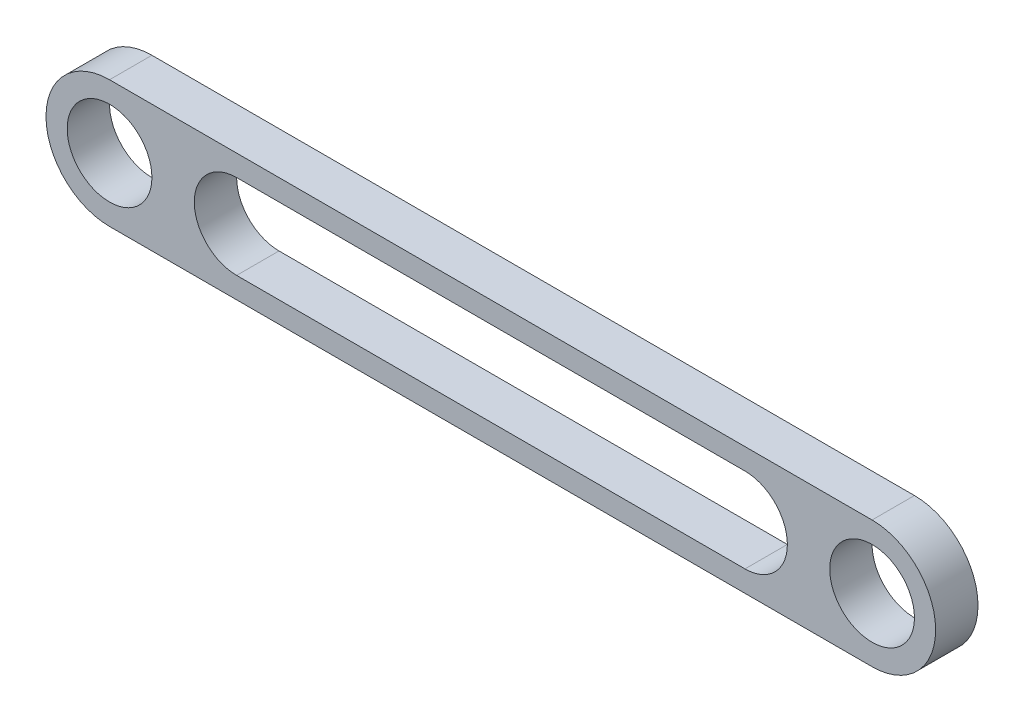
ISO-10303-21;
HEADER;
FILE_DESCRIPTION(('STEP AP214'),'2;1');
FILE_NAME('part.step','',(''),(''),'','','');
FILE_SCHEMA(('AUTOMOTIVE_DESIGN { 1 0 10303 214 1 1 1 1 }'));
ENDSEC;
DATA;
#1=APPLICATION_CONTEXT('core data for automotive mechanical design processes');
#2=APPLICATION_PROTOCOL_DEFINITION('international standard','automotive_design',2000,#1);
#3=PRODUCT_CONTEXT('',#1,'mechanical');
#4=PRODUCT('Part','Part','',(#3));
#5=PRODUCT_RELATED_PRODUCT_CATEGORY('part','',(#4));
#6=PRODUCT_DEFINITION_FORMATION('','',#4);
#7=PRODUCT_DEFINITION_CONTEXT('part definition',#1,'design');
#8=PRODUCT_DEFINITION('design','',#6,#7);
#9=PRODUCT_DEFINITION_SHAPE('','',#8);
#10=(LENGTH_UNIT() NAMED_UNIT(*) SI_UNIT(.MILLI.,.METRE.));
#11=(NAMED_UNIT(*) PLANE_ANGLE_UNIT() SI_UNIT($,.RADIAN.));
#12=(NAMED_UNIT(*) SI_UNIT($,.STERADIAN.) SOLID_ANGLE_UNIT());
#13=UNCERTAINTY_MEASURE_WITH_UNIT(LENGTH_MEASURE(1.E-05),#10,'distance_accuracy_value','');
#14=(GEOMETRIC_REPRESENTATION_CONTEXT(3) GLOBAL_UNCERTAINTY_ASSIGNED_CONTEXT((#13)) GLOBAL_UNIT_ASSIGNED_CONTEXT((#10,
#11,#12)) REPRESENTATION_CONTEXT('',''));
#15=CARTESIAN_POINT('',(0.,0.,0.));
#16=DIRECTION('',(0.,0.,1.));
#17=DIRECTION('',(1.,0.,0.));
#18=AXIS2_PLACEMENT_3D('',#15,#16,#17);
#19=CARTESIAN_POINT('',(0.,0.,10.));
#20=DIRECTION('',(0.,0.,1.));
#21=DIRECTION('',(1.,0.,0.));
#22=AXIS2_PLACEMENT_3D('',#19,#20,#21);
#23=PLANE('',#22);
#24=CARTESIAN_POINT('',(0.,0.,10.));
#25=DIRECTION('',(0.,0.,1.));
#26=DIRECTION('',(1.,0.,0.));
#27=AXIS2_PLACEMENT_3D('',#24,#25,#26);
#28=CIRCLE('',#27,10.);
#29=CARTESIAN_POINT('',(10.,0.,10.));
#30=VERTEX_POINT('',#29);
#31=EDGE_CURVE('E167',#30,#30,#28,.T.);
#32=ORIENTED_EDGE('',*,*,#31,.F.);
#33=EDGE_LOOP('',(#32));
#34=FACE_BOUND('',#33,.T.);
#35=CARTESIAN_POINT('',(0.,0.,10.));
#36=DIRECTION('',(0.,0.,1.));
#37=DIRECTION('',(1.,0.,0.));
#38=AXIS2_PLACEMENT_3D('',#35,#36,#37);
#39=CIRCLE('',#38,15.);
#40=CARTESIAN_POINT('',(0.,15.,10.));
#41=VERTEX_POINT('',#40);
#42=CARTESIAN_POINT('',(0.,-15.,10.));
#43=VERTEX_POINT('',#42);
#44=EDGE_CURVE('E175',#41,#43,#39,.T.);
#45=ORIENTED_EDGE('',*,*,#44,.T.);
#46=DIRECTION('',(1.,0.,0.));
#47=VECTOR('',#46,1.);
#48=CARTESIAN_POINT('',(0.,-15.,10.));
#49=LINE('',#48,#47);
#50=CARTESIAN_POINT('',(180.,-15.,10.));
#51=VERTEX_POINT('',#50);
#52=EDGE_CURVE('E179',#43,#51,#49,.T.);
#53=ORIENTED_EDGE('',*,*,#52,.T.);
#54=CARTESIAN_POINT('',(180.,0.,10.));
#55=DIRECTION('',(0.,0.,1.));
#56=DIRECTION('',(1.,0.,0.));
#57=AXIS2_PLACEMENT_3D('',#54,#55,#56);
#58=CIRCLE('',#57,15.);
#59=CARTESIAN_POINT('',(180.,15.,10.));
#60=VERTEX_POINT('',#59);
#61=EDGE_CURVE('E183',#51,#60,#58,.T.);
#62=ORIENTED_EDGE('',*,*,#61,.T.);
#63=DIRECTION('',(-1.,0.,0.));
#64=VECTOR('',#63,1.);
#65=CARTESIAN_POINT('',(0.,15.,10.));
#66=LINE('',#65,#64);
#67=EDGE_CURVE('E186',#60,#41,#66,.T.);
#68=ORIENTED_EDGE('',*,*,#67,.T.);
#69=EDGE_LOOP('',(#45,#53,#62,#68));
#70=FACE_BOUND('',#69,.T.);
#71=CARTESIAN_POINT('',(180.,0.,10.));
#72=DIRECTION('',(0.,0.,1.));
#73=DIRECTION('',(1.,0.,0.));
#74=AXIS2_PLACEMENT_3D('',#71,#72,#73);
#75=CIRCLE('',#74,9.99999999999998);
#76=CARTESIAN_POINT('',(190.,0.,10.));
#77=VERTEX_POINT('',#76);
#78=EDGE_CURVE('E159',#77,#77,#75,.T.);
#79=ORIENTED_EDGE('',*,*,#78,.F.);
#80=EDGE_LOOP('',(#79));
#81=FACE_BOUND('',#80,.T.);
#82=DIRECTION('',(1.,0.,0.));
#83=VECTOR('',#82,1.);
#84=CARTESIAN_POINT('',(150.,-10.,10.));
#85=LINE('',#84,#83);
#86=CARTESIAN_POINT('',(30.,-10.,10.));
#87=VERTEX_POINT('',#86);
#88=CARTESIAN_POINT('',(150.,-10.,10.));
#89=VERTEX_POINT('',#88);
#90=EDGE_CURVE('E120',#87,#89,#85,.T.);
#91=ORIENTED_EDGE('',*,*,#90,.F.);
#92=CARTESIAN_POINT('',(30.,0.,10.));
#93=DIRECTION('',(0.,0.,1.));
#94=DIRECTION('',(1.,0.,0.));
#95=AXIS2_PLACEMENT_3D('',#92,#93,#94);
#96=CIRCLE('',#95,10.);
#97=CARTESIAN_POINT('',(30.,10.,10.));
#98=VERTEX_POINT('',#97);
#99=EDGE_CURVE('E111',#98,#87,#96,.T.);
#100=ORIENTED_EDGE('',*,*,#99,.F.);
#101=DIRECTION('',(-1.,0.,0.));
#102=VECTOR('',#101,1.);
#103=CARTESIAN_POINT('',(30.,10.,10.));
#104=LINE('',#103,#102);
#105=CARTESIAN_POINT('',(150.,10.,10.));
#106=VERTEX_POINT('',#105);
#107=EDGE_CURVE('E137',#106,#98,#104,.T.);
#108=ORIENTED_EDGE('',*,*,#107,.F.);
#109=CARTESIAN_POINT('',(150.,0.,10.));
#110=DIRECTION('',(0.,0.,1.));
#111=DIRECTION('',(1.,0.,0.));
#112=AXIS2_PLACEMENT_3D('',#109,#110,#111);
#113=CIRCLE('',#112,10.);
#114=EDGE_CURVE('E133',#89,#106,#113,.T.);
#115=ORIENTED_EDGE('',*,*,#114,.F.);
#116=EDGE_LOOP('',(#91,#100,#108,#115));
#117=FACE_BOUND('',#116,.T.);
#118=ADVANCED_FACE('F45',(#34,#70,#81,#117),#23,.T.);
#119=CARTESIAN_POINT('',(0.,0.,0.));
#120=DIRECTION('',(0.,0.,1.));
#121=DIRECTION('',(1.,0.,0.));
#122=AXIS2_PLACEMENT_3D('',#119,#120,#121);
#123=PLANE('',#122);
#124=CARTESIAN_POINT('',(180.,0.,0.));
#125=DIRECTION('',(0.,0.,1.));
#126=DIRECTION('',(1.,0.,0.));
#127=AXIS2_PLACEMENT_3D('',#124,#125,#126);
#128=CIRCLE('',#127,9.99999999999998);
#129=CARTESIAN_POINT('',(190.,0.,0.));
#130=VERTEX_POINT('',#129);
#131=EDGE_CURVE('E129',#130,#130,#128,.T.);
#132=ORIENTED_EDGE('',*,*,#131,.T.);
#133=EDGE_LOOP('',(#132));
#134=FACE_BOUND('',#133,.T.);
#135=CARTESIAN_POINT('',(0.,0.,0.));
#136=DIRECTION('',(0.,0.,1.));
#137=DIRECTION('',(1.,0.,0.));
#138=AXIS2_PLACEMENT_3D('',#135,#136,#137);
#139=CIRCLE('',#138,10.);
#140=CARTESIAN_POINT('',(10.,0.,0.));
#141=VERTEX_POINT('',#140);
#142=EDGE_CURVE('E163',#141,#141,#139,.T.);
#143=ORIENTED_EDGE('',*,*,#142,.T.);
#144=EDGE_LOOP('',(#143));
#145=FACE_BOUND('',#144,.T.);
#146=CARTESIAN_POINT('',(0.,0.,0.));
#147=DIRECTION('',(0.,0.,1.));
#148=DIRECTION('',(1.,0.,0.));
#149=AXIS2_PLACEMENT_3D('',#146,#147,#148);
#150=CIRCLE('',#149,15.);
#151=CARTESIAN_POINT('',(0.,15.,0.));
#152=VERTEX_POINT('',#151);
#153=CARTESIAN_POINT('',(0.,-15.,0.));
#154=VERTEX_POINT('',#153);
#155=EDGE_CURVE('E171',#152,#154,#150,.T.);
#156=ORIENTED_EDGE('',*,*,#155,.F.);
#157=DIRECTION('',(-1.,0.,0.));
#158=VECTOR('',#157,1.);
#159=CARTESIAN_POINT('',(0.,15.,0.));
#160=LINE('',#159,#158);
#161=CARTESIAN_POINT('',(180.,15.,0.));
#162=VERTEX_POINT('',#161);
#163=EDGE_CURVE('E180',#162,#152,#160,.T.);
#164=ORIENTED_EDGE('',*,*,#163,.F.);
#165=CARTESIAN_POINT('',(180.,0.,0.));
#166=DIRECTION('',(0.,0.,1.));
#167=DIRECTION('',(1.,0.,0.));
#168=AXIS2_PLACEMENT_3D('',#165,#166,#167);
#169=CIRCLE('',#168,15.);
#170=CARTESIAN_POINT('',(180.,-15.,0.));
#171=VERTEX_POINT('',#170);
#172=EDGE_CURVE('E196',#171,#162,#169,.T.);
#173=ORIENTED_EDGE('',*,*,#172,.F.);
#174=DIRECTION('',(1.,0.,0.));
#175=VECTOR('',#174,1.);
#176=CARTESIAN_POINT('',(0.,-15.,0.));
#177=LINE('',#176,#175);
#178=EDGE_CURVE('E193',#154,#171,#177,.T.);
#179=ORIENTED_EDGE('',*,*,#178,.F.);
#180=EDGE_LOOP('',(#156,#164,#173,#179));
#181=FACE_BOUND('',#180,.T.);
#182=CARTESIAN_POINT('',(30.,0.,0.));
#183=DIRECTION('',(0.,0.,1.));
#184=DIRECTION('',(1.,0.,0.));
#185=AXIS2_PLACEMENT_3D('',#182,#183,#184);
#186=CIRCLE('',#185,10.);
#187=CARTESIAN_POINT('',(30.,10.,0.));
#188=VERTEX_POINT('',#187);
#189=CARTESIAN_POINT('',(30.,-10.,0.));
#190=VERTEX_POINT('',#189);
#191=EDGE_CURVE('E69',#188,#190,#186,.T.);
#192=ORIENTED_EDGE('',*,*,#191,.T.);
#193=DIRECTION('',(1.,0.,0.));
#194=VECTOR('',#193,1.);
#195=CARTESIAN_POINT('',(150.,-10.,0.));
#196=LINE('',#195,#194);
#197=CARTESIAN_POINT('',(150.,-10.,0.));
#198=VERTEX_POINT('',#197);
#199=EDGE_CURVE('E127',#190,#198,#196,.T.);
#200=ORIENTED_EDGE('',*,*,#199,.T.);
#201=CARTESIAN_POINT('',(150.,0.,0.));
#202=DIRECTION('',(0.,0.,1.));
#203=DIRECTION('',(1.,0.,0.));
#204=AXIS2_PLACEMENT_3D('',#201,#202,#203);
#205=CIRCLE('',#204,10.);
#206=CARTESIAN_POINT('',(150.,10.,0.));
#207=VERTEX_POINT('',#206);
#208=EDGE_CURVE('E146',#198,#207,#205,.T.);
#209=ORIENTED_EDGE('',*,*,#208,.T.);
#210=DIRECTION('',(-1.,0.,0.));
#211=VECTOR('',#210,1.);
#212=CARTESIAN_POINT('',(30.,10.,0.));
#213=LINE('',#212,#211);
#214=EDGE_CURVE('E121',#207,#188,#213,.T.);
#215=ORIENTED_EDGE('',*,*,#214,.T.);
#216=EDGE_LOOP('',(#192,#200,#209,#215));
#217=FACE_BOUND('',#216,.T.);
#218=ADVANCED_FACE('F219',(#134,#145,#181,#217),#123,.F.);
#219=CARTESIAN_POINT('',(0.,0.,10.));
#220=DIRECTION('',(0.,0.,-1.));
#221=DIRECTION('',(-1.,0.,0.));
#222=AXIS2_PLACEMENT_3D('',#219,#220,#221);
#223=CYLINDRICAL_SURFACE('',#222,15.);
#224=ORIENTED_EDGE('',*,*,#155,.T.);
#225=DIRECTION('',(0.,0.,-1.));
#226=VECTOR('',#225,1.);
#227=CARTESIAN_POINT('',(0.,-15.,10.));
#228=LINE('',#227,#226);
#229=EDGE_CURVE('E11',#43,#154,#228,.T.);
#230=ORIENTED_EDGE('',*,*,#229,.F.);
#231=ORIENTED_EDGE('',*,*,#44,.F.);
#232=DIRECTION('',(0.,0.,-1.));
#233=VECTOR('',#232,1.);
#234=CARTESIAN_POINT('',(0.,15.,10.));
#235=LINE('',#234,#233);
#236=EDGE_CURVE('E189',#41,#152,#235,.T.);
#237=ORIENTED_EDGE('',*,*,#236,.T.);
#238=EDGE_LOOP('',(#224,#230,#231,#237));
#239=FACE_BOUND('',#238,.T.);
#240=ADVANCED_FACE('F47',(#239),#223,.T.);
#241=CARTESIAN_POINT('',(0.,-15.,10.));
#242=DIRECTION('',(0.,1.,0.));
#243=DIRECTION('',(0.,0.,1.));
#244=AXIS2_PLACEMENT_3D('',#241,#242,#243);
#245=PLANE('',#244);
#246=ORIENTED_EDGE('',*,*,#178,.T.);
#247=DIRECTION('',(0.,0.,-1.));
#248=VECTOR('',#247,1.);
#249=CARTESIAN_POINT('',(180.,-15.,10.));
#250=LINE('',#249,#248);
#251=EDGE_CURVE('E54',#51,#171,#250,.T.);
#252=ORIENTED_EDGE('',*,*,#251,.F.);
#253=ORIENTED_EDGE('',*,*,#52,.F.);
#254=ORIENTED_EDGE('',*,*,#229,.T.);
#255=EDGE_LOOP('',(#246,#252,#253,#254));
#256=FACE_BOUND('',#255,.T.);
#257=ADVANCED_FACE('F230',(#256),#245,.F.);
#258=CARTESIAN_POINT('',(180.,0.,10.));
#259=DIRECTION('',(0.,0.,-1.));
#260=DIRECTION('',(-1.,0.,0.));
#261=AXIS2_PLACEMENT_3D('',#258,#259,#260);
#262=CYLINDRICAL_SURFACE('',#261,15.);
#263=ORIENTED_EDGE('',*,*,#172,.T.);
#264=DIRECTION('',(0.,0.,-1.));
#265=VECTOR('',#264,1.);
#266=CARTESIAN_POINT('',(180.,15.,10.));
#267=LINE('',#266,#265);
#268=EDGE_CURVE('E204',#60,#162,#267,.T.);
#269=ORIENTED_EDGE('',*,*,#268,.F.);
#270=ORIENTED_EDGE('',*,*,#61,.F.);
#271=ORIENTED_EDGE('',*,*,#251,.T.);
#272=EDGE_LOOP('',(#263,#269,#270,#271));
#273=FACE_BOUND('',#272,.T.);
#274=ADVANCED_FACE('F213',(#273),#262,.T.);
#275=CARTESIAN_POINT('',(0.,15.,10.));
#276=DIRECTION('',(0.,-1.,0.));
#277=DIRECTION('',(0.,0.,-1.));
#278=AXIS2_PLACEMENT_3D('',#275,#276,#277);
#279=PLANE('',#278);
#280=ORIENTED_EDGE('',*,*,#163,.T.);
#281=ORIENTED_EDGE('',*,*,#236,.F.);
#282=ORIENTED_EDGE('',*,*,#67,.F.);
#283=ORIENTED_EDGE('',*,*,#268,.T.);
#284=EDGE_LOOP('',(#280,#281,#282,#283));
#285=FACE_BOUND('',#284,.T.);
#286=ADVANCED_FACE('F223',(#285),#279,.F.);
#287=CARTESIAN_POINT('',(0.,0.,10.));
#288=DIRECTION('',(0.,0.,-1.));
#289=DIRECTION('',(-1.,0.,0.));
#290=AXIS2_PLACEMENT_3D('',#287,#288,#289);
#291=CYLINDRICAL_SURFACE('',#290,10.);
#292=ORIENTED_EDGE('',*,*,#31,.T.);
#293=EDGE_LOOP('',(#292));
#294=FACE_BOUND('',#293,.T.);
#295=ORIENTED_EDGE('',*,*,#142,.F.);
#296=EDGE_LOOP('',(#295));
#297=FACE_BOUND('',#296,.T.);
#298=ADVANCED_FACE('F247',(#294,#297),#291,.F.);
#299=CARTESIAN_POINT('',(180.,0.,10.));
#300=DIRECTION('',(0.,0.,-1.));
#301=DIRECTION('',(-1.,0.,0.));
#302=AXIS2_PLACEMENT_3D('',#299,#300,#301);
#303=CYLINDRICAL_SURFACE('',#302,9.99999999999998);
#304=ORIENTED_EDGE('',*,*,#78,.T.);
#305=EDGE_LOOP('',(#304));
#306=FACE_BOUND('',#305,.T.);
#307=ORIENTED_EDGE('',*,*,#131,.F.);
#308=EDGE_LOOP('',(#307));
#309=FACE_BOUND('',#308,.T.);
#310=ADVANCED_FACE('F254',(#306,#309),#303,.F.);
#311=CARTESIAN_POINT('',(30.,0.,10.));
#312=DIRECTION('',(0.,0.,-1.));
#313=DIRECTION('',(-1.,0.,0.));
#314=AXIS2_PLACEMENT_3D('',#311,#312,#313);
#315=CYLINDRICAL_SURFACE('',#314,10.);
#316=ORIENTED_EDGE('',*,*,#191,.F.);
#317=DIRECTION('',(0.,0.,-1.));
#318=VECTOR('',#317,1.);
#319=CARTESIAN_POINT('',(30.,10.,10.));
#320=LINE('',#319,#318);
#321=EDGE_CURVE('E115',#98,#188,#320,.T.);
#322=ORIENTED_EDGE('',*,*,#321,.F.);
#323=ORIENTED_EDGE('',*,*,#99,.T.);
#324=DIRECTION('',(0.,0.,-1.));
#325=VECTOR('',#324,1.);
#326=CARTESIAN_POINT('',(30.,-10.,10.));
#327=LINE('',#326,#325);
#328=EDGE_CURVE('E114',#87,#190,#327,.T.);
#329=ORIENTED_EDGE('',*,*,#328,.T.);
#330=EDGE_LOOP('',(#316,#322,#323,#329));
#331=FACE_BOUND('',#330,.T.);
#332=ADVANCED_FACE('F113',(#331),#315,.F.);
#333=CARTESIAN_POINT('',(150.,-10.,10.));
#334=DIRECTION('',(0.,1.,0.));
#335=DIRECTION('',(-1.,0.,0.));
#336=AXIS2_PLACEMENT_3D('',#333,#334,#335);
#337=PLANE('',#336);
#338=ORIENTED_EDGE('',*,*,#199,.F.);
#339=ORIENTED_EDGE('',*,*,#328,.F.);
#340=ORIENTED_EDGE('',*,*,#90,.T.);
#341=DIRECTION('',(0.,0.,-1.));
#342=VECTOR('',#341,1.);
#343=CARTESIAN_POINT('',(150.,-10.,10.));
#344=LINE('',#343,#342);
#345=EDGE_CURVE('E130',#89,#198,#344,.T.);
#346=ORIENTED_EDGE('',*,*,#345,.T.);
#347=EDGE_LOOP('',(#338,#339,#340,#346));
#348=FACE_BOUND('',#347,.T.);
#349=ADVANCED_FACE('F124',(#348),#337,.T.);
#350=CARTESIAN_POINT('',(150.,0.,10.));
#351=DIRECTION('',(0.,0.,-1.));
#352=DIRECTION('',(-1.,0.,0.));
#353=AXIS2_PLACEMENT_3D('',#350,#351,#352);
#354=CYLINDRICAL_SURFACE('',#353,10.);
#355=ORIENTED_EDGE('',*,*,#208,.F.);
#356=ORIENTED_EDGE('',*,*,#345,.F.);
#357=ORIENTED_EDGE('',*,*,#114,.T.);
#358=DIRECTION('',(0.,0.,-1.));
#359=VECTOR('',#358,1.);
#360=CARTESIAN_POINT('',(150.,10.,10.));
#361=LINE('',#360,#359);
#362=EDGE_CURVE('E61',#106,#207,#361,.T.);
#363=ORIENTED_EDGE('',*,*,#362,.T.);
#364=EDGE_LOOP('',(#355,#356,#357,#363));
#365=FACE_BOUND('',#364,.T.);
#366=ADVANCED_FACE('F271',(#365),#354,.F.);
#367=CARTESIAN_POINT('',(30.,10.,10.));
#368=DIRECTION('',(0.,-1.,0.));
#369=DIRECTION('',(1.,0.,0.));
#370=AXIS2_PLACEMENT_3D('',#367,#368,#369);
#371=PLANE('',#370);
#372=ORIENTED_EDGE('',*,*,#214,.F.);
#373=ORIENTED_EDGE('',*,*,#362,.F.);
#374=ORIENTED_EDGE('',*,*,#107,.T.);
#375=ORIENTED_EDGE('',*,*,#321,.T.);
#376=EDGE_LOOP('',(#372,#373,#374,#375));
#377=FACE_BOUND('',#376,.T.);
#378=ADVANCED_FACE('F274',(#377),#371,.T.);
#379=CLOSED_SHELL('',(#118,#218,#240,#257,#274,#286,#298,#310,#332,#349,#366,#378));
#380=MANIFOLD_SOLID_BREP('B2',#379);
#381=ADVANCED_BREP_SHAPE_REPRESENTATION('',(#18,#380),#14);
#382=SHAPE_DEFINITION_REPRESENTATION(#9,#381);
ENDSEC;
END-ISO-10303-21;
